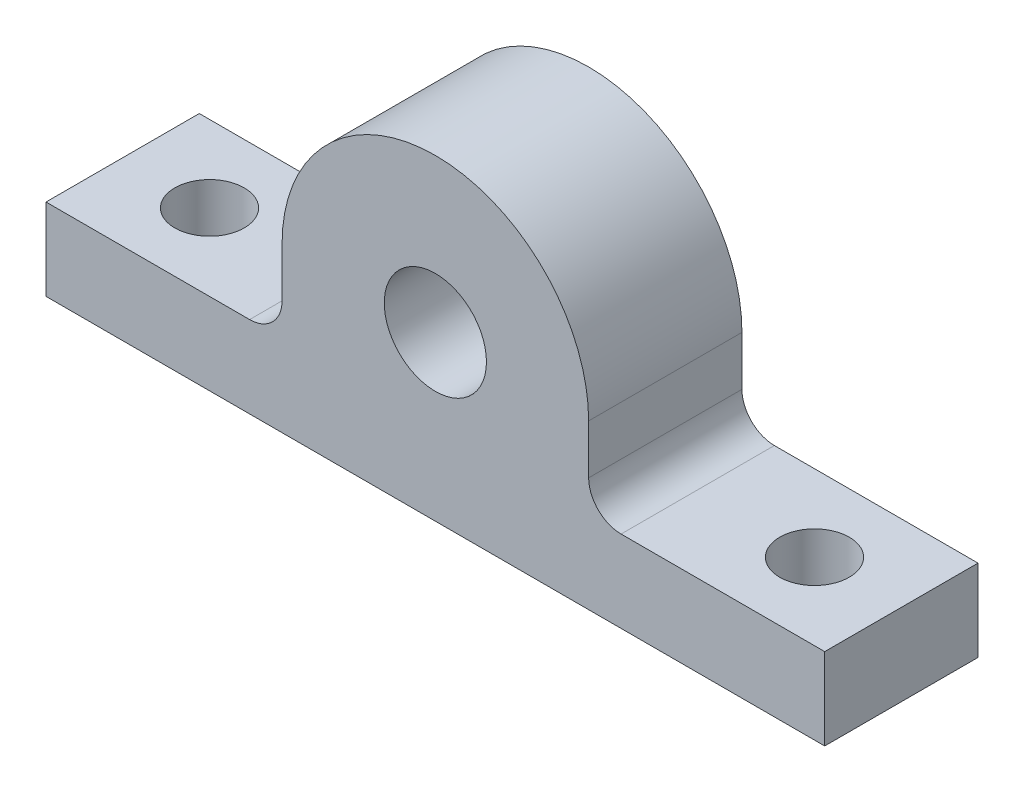
ISO-10303-21;
HEADER;
FILE_DESCRIPTION(('STEP AP214'),'2;1');
FILE_NAME('part.step','',(''),(''),'','','');
FILE_SCHEMA(('AUTOMOTIVE_DESIGN { 1 0 10303 214 1 1 1 1 }'));
ENDSEC;
DATA;
#1=APPLICATION_CONTEXT('core data for automotive mechanical design processes');
#2=APPLICATION_PROTOCOL_DEFINITION('international standard','automotive_design',2000,#1);
#3=PRODUCT_CONTEXT('',#1,'mechanical');
#4=PRODUCT('Part','Part','',(#3));
#5=PRODUCT_RELATED_PRODUCT_CATEGORY('part','',(#4));
#6=PRODUCT_DEFINITION_FORMATION('','',#4);
#7=PRODUCT_DEFINITION_CONTEXT('part definition',#1,'design');
#8=PRODUCT_DEFINITION('design','',#6,#7);
#9=PRODUCT_DEFINITION_SHAPE('','',#8);
#10=(LENGTH_UNIT() NAMED_UNIT(*) SI_UNIT(.MILLI.,.METRE.));
#11=(NAMED_UNIT(*) PLANE_ANGLE_UNIT() SI_UNIT($,.RADIAN.));
#12=(NAMED_UNIT(*) SI_UNIT($,.STERADIAN.) SOLID_ANGLE_UNIT());
#13=UNCERTAINTY_MEASURE_WITH_UNIT(LENGTH_MEASURE(1.E-05),#10,'distance_accuracy_value','');
#14=(GEOMETRIC_REPRESENTATION_CONTEXT(3) GLOBAL_UNCERTAINTY_ASSIGNED_CONTEXT((#13)) GLOBAL_UNIT_ASSIGNED_CONTEXT((#10,
#11,#12)) REPRESENTATION_CONTEXT('',''));
#15=CARTESIAN_POINT('',(0.,0.,0.));
#16=DIRECTION('',(0.,0.,1.));
#17=DIRECTION('',(1.,0.,0.));
#18=AXIS2_PLACEMENT_3D('',#15,#16,#17);
#19=CARTESIAN_POINT('',(15.,0.,15.));
#20=DIRECTION('',(-1.,0.,0.));
#21=DIRECTION('',(0.,0.,1.));
#22=AXIS2_PLACEMENT_3D('',#19,#20,#21);
#23=PLANE('',#22);
#24=DIRECTION('',(0.,1.,0.));
#25=VECTOR('',#24,1.);
#26=CARTESIAN_POINT('',(15.,0.,15.));
#27=LINE('',#26,#25);
#28=CARTESIAN_POINT('',(15.,7.175,15.));
#29=VERTEX_POINT('',#28);
#30=CARTESIAN_POINT('',(15.,12.,15.));
#31=VERTEX_POINT('',#30);
#32=EDGE_CURVE('E109',#29,#31,#27,.T.);
#33=ORIENTED_EDGE('',*,*,#32,.F.);
#34=DIRECTION('',(0.,0.,-1.));
#35=VECTOR('',#34,1.);
#36=CARTESIAN_POINT('',(15.,7.175,15.));
#37=LINE('',#36,#35);
#38=CARTESIAN_POINT('',(15.,7.175,0.));
#39=VERTEX_POINT('',#38);
#40=EDGE_CURVE('E189',#29,#39,#37,.T.);
#41=ORIENTED_EDGE('',*,*,#40,.T.);
#42=DIRECTION('',(0.,1.,0.));
#43=VECTOR('',#42,1.);
#44=CARTESIAN_POINT('',(15.,0.,0.));
#45=LINE('',#44,#43);
#46=CARTESIAN_POINT('',(15.,12.,0.));
#47=VERTEX_POINT('',#46);
#48=EDGE_CURVE('E124',#39,#47,#45,.T.);
#49=ORIENTED_EDGE('',*,*,#48,.T.);
#50=DIRECTION('',(0.,0.,-1.));
#51=VECTOR('',#50,1.);
#52=CARTESIAN_POINT('',(15.,12.,15.));
#53=LINE('',#52,#51);
#54=EDGE_CURVE('E123',#31,#47,#53,.T.);
#55=ORIENTED_EDGE('',*,*,#54,.F.);
#56=EDGE_LOOP('',(#33,#41,#49,#55));
#57=FACE_BOUND('',#56,.T.);
#58=ADVANCED_FACE('F34',(#57),#23,.F.);
#59=CARTESIAN_POINT('',(0.,12.,15.));
#60=DIRECTION('',(0.,0.,-1.));
#61=DIRECTION('',(-1.,0.,0.));
#62=AXIS2_PLACEMENT_3D('',#59,#60,#61);
#63=CYLINDRICAL_SURFACE('',#62,15.);
#64=CARTESIAN_POINT('',(0.,12.,0.));
#65=DIRECTION('',(0.,0.,1.));
#66=DIRECTION('',(1.,0.,0.));
#67=AXIS2_PLACEMENT_3D('',#64,#65,#66);
#68=CIRCLE('',#67,15.);
#69=CARTESIAN_POINT('',(-15.,12.,0.));
#70=VERTEX_POINT('',#69);
#71=EDGE_CURVE('E156',#70,#47,#68,.F.);
#72=ORIENTED_EDGE('',*,*,#71,.F.);
#73=DIRECTION('',(0.,0.,-1.));
#74=VECTOR('',#73,1.);
#75=CARTESIAN_POINT('',(-15.,12.,15.));
#76=LINE('',#75,#74);
#77=CARTESIAN_POINT('',(-15.,12.,15.));
#78=VERTEX_POINT('',#77);
#79=EDGE_CURVE('E129',#78,#70,#76,.T.);
#80=ORIENTED_EDGE('',*,*,#79,.F.);
#81=CARTESIAN_POINT('',(0.,12.,15.));
#82=DIRECTION('',(0.,0.,1.));
#83=DIRECTION('',(1.,0.,0.));
#84=AXIS2_PLACEMENT_3D('',#81,#82,#83);
#85=CIRCLE('',#84,15.);
#86=EDGE_CURVE('E115',#78,#31,#85,.F.);
#87=ORIENTED_EDGE('',*,*,#86,.T.);
#88=ORIENTED_EDGE('',*,*,#54,.T.);
#89=EDGE_LOOP('',(#72,#80,#87,#88));
#90=FACE_BOUND('',#89,.T.);
#91=ADVANCED_FACE('F132',(#90),#63,.T.);
#92=CARTESIAN_POINT('',(-15.,0.,15.));
#93=DIRECTION('',(-1.,0.,0.));
#94=DIRECTION('',(0.,0.,1.));
#95=AXIS2_PLACEMENT_3D('',#92,#93,#94);
#96=PLANE('',#95);
#97=DIRECTION('',(0.,1.,0.));
#98=VECTOR('',#97,1.);
#99=CARTESIAN_POINT('',(-15.,0.,0.));
#100=LINE('',#99,#98);
#101=CARTESIAN_POINT('',(-15.,7.175,0.));
#102=VERTEX_POINT('',#101);
#103=EDGE_CURVE('E159',#102,#70,#100,.T.);
#104=ORIENTED_EDGE('',*,*,#103,.F.);
#105=DIRECTION('',(0.,0.,-1.));
#106=VECTOR('',#105,1.);
#107=CARTESIAN_POINT('',(-15.,7.175,15.));
#108=LINE('',#107,#106);
#109=CARTESIAN_POINT('',(-15.,7.175,15.));
#110=VERTEX_POINT('',#109);
#111=EDGE_CURVE('E187',#102,#110,#108,.F.);
#112=ORIENTED_EDGE('',*,*,#111,.T.);
#113=DIRECTION('',(0.,1.,0.));
#114=VECTOR('',#113,1.);
#115=CARTESIAN_POINT('',(-15.,0.,15.));
#116=LINE('',#115,#114);
#117=EDGE_CURVE('E134',#110,#78,#116,.T.);
#118=ORIENTED_EDGE('',*,*,#117,.T.);
#119=ORIENTED_EDGE('',*,*,#79,.T.);
#120=EDGE_LOOP('',(#104,#112,#118,#119));
#121=FACE_BOUND('',#120,.T.);
#122=ADVANCED_FACE('F209',(#121),#96,.T.);
#123=CARTESIAN_POINT('',(0.,4.,15.));
#124=DIRECTION('',(0.,1.,0.));
#125=DIRECTION('',(0.,0.,1.));
#126=AXIS2_PLACEMENT_3D('',#123,#124,#125);
#127=PLANE('',#126);
#128=CARTESIAN_POINT('',(-29.6,4.,7.5));
#129=DIRECTION('',(0.,1.,0.));
#130=DIRECTION('',(0.,0.,1.));
#131=AXIS2_PLACEMENT_3D('',#128,#129,#130);
#132=CIRCLE('',#131,3.4);
#133=CARTESIAN_POINT('',(-29.6,4.,10.9));
#134=VERTEX_POINT('',#133);
#135=EDGE_CURVE('E375',#134,#134,#132,.T.);
#136=ORIENTED_EDGE('',*,*,#135,.F.);
#137=EDGE_LOOP('',(#136));
#138=FACE_BOUND('',#137,.T.);
#139=DIRECTION('',(1.,0.,0.));
#140=VECTOR('',#139,1.);
#141=CARTESIAN_POINT('',(0.,4.,15.));
#142=LINE('',#141,#140);
#143=CARTESIAN_POINT('',(-38.1,4.,15.));
#144=VERTEX_POINT('',#143);
#145=CARTESIAN_POINT('',(-18.175,4.,15.));
#146=VERTEX_POINT('',#145);
#147=EDGE_CURVE('E136',#144,#146,#142,.T.);
#148=ORIENTED_EDGE('',*,*,#147,.T.);
#149=DIRECTION('',(0.,0.,-1.));
#150=VECTOR('',#149,1.);
#151=CARTESIAN_POINT('',(-18.175,4.,0.));
#152=LINE('',#151,#150);
#153=CARTESIAN_POINT('',(-18.175,4.,0.));
#154=VERTEX_POINT('',#153);
#155=EDGE_CURVE('E128',#146,#154,#152,.T.);
#156=ORIENTED_EDGE('',*,*,#155,.T.);
#157=DIRECTION('',(1.,0.,0.));
#158=VECTOR('',#157,1.);
#159=CARTESIAN_POINT('',(0.,4.,0.));
#160=LINE('',#159,#158);
#161=CARTESIAN_POINT('',(-38.1,4.,0.));
#162=VERTEX_POINT('',#161);
#163=EDGE_CURVE('E161',#162,#154,#160,.T.);
#164=ORIENTED_EDGE('',*,*,#163,.F.);
#165=DIRECTION('',(0.,0.,-1.));
#166=VECTOR('',#165,1.);
#167=CARTESIAN_POINT('',(-38.1,4.,15.));
#168=LINE('',#167,#166);
#169=EDGE_CURVE('E182',#144,#162,#168,.T.);
#170=ORIENTED_EDGE('',*,*,#169,.F.);
#171=EDGE_LOOP('',(#148,#156,#164,#170));
#172=FACE_BOUND('',#171,.T.);
#173=ADVANCED_FACE('F202',(#138,#172),#127,.T.);
#174=CARTESIAN_POINT('',(-38.1,0.,15.));
#175=DIRECTION('',(-1.,0.,0.));
#176=DIRECTION('',(0.,0.,1.));
#177=AXIS2_PLACEMENT_3D('',#174,#175,#176);
#178=PLANE('',#177);
#179=DIRECTION('',(0.,1.,0.));
#180=VECTOR('',#179,1.);
#181=CARTESIAN_POINT('',(-38.1,0.,0.));
#182=LINE('',#181,#180);
#183=CARTESIAN_POINT('',(-38.1,-4.,0.));
#184=VERTEX_POINT('',#183);
#185=EDGE_CURVE('E164',#184,#162,#182,.T.);
#186=ORIENTED_EDGE('',*,*,#185,.F.);
#187=DIRECTION('',(0.,0.,-1.));
#188=VECTOR('',#187,1.);
#189=CARTESIAN_POINT('',(-38.1,-4.,15.));
#190=LINE('',#189,#188);
#191=CARTESIAN_POINT('',(-38.1,-4.,15.));
#192=VERTEX_POINT('',#191);
#193=EDGE_CURVE('E180',#192,#184,#190,.T.);
#194=ORIENTED_EDGE('',*,*,#193,.F.);
#195=DIRECTION('',(0.,1.,0.));
#196=VECTOR('',#195,1.);
#197=CARTESIAN_POINT('',(-38.1,0.,15.));
#198=LINE('',#197,#196);
#199=EDGE_CURVE('E142',#192,#144,#198,.T.);
#200=ORIENTED_EDGE('',*,*,#199,.T.);
#201=ORIENTED_EDGE('',*,*,#169,.T.);
#202=EDGE_LOOP('',(#186,#194,#200,#201));
#203=FACE_BOUND('',#202,.T.);
#204=ADVANCED_FACE('F216',(#203),#178,.T.);
#205=CARTESIAN_POINT('',(0.,-4.,15.));
#206=DIRECTION('',(0.,1.,0.));
#207=DIRECTION('',(0.,0.,1.));
#208=AXIS2_PLACEMENT_3D('',#205,#206,#207);
#209=PLANE('',#208);
#210=CARTESIAN_POINT('',(29.6,-4.,7.5));
#211=DIRECTION('',(0.,1.,0.));
#212=DIRECTION('',(0.,0.,1.));
#213=AXIS2_PLACEMENT_3D('',#210,#211,#212);
#214=CIRCLE('',#213,3.4);
#215=CARTESIAN_POINT('',(29.6,-4.,10.9));
#216=VERTEX_POINT('',#215);
#217=EDGE_CURVE('E374',#216,#216,#214,.T.);
#218=ORIENTED_EDGE('',*,*,#217,.T.);
#219=EDGE_LOOP('',(#218));
#220=FACE_BOUND('',#219,.T.);
#221=CARTESIAN_POINT('',(-29.6,-4.,7.5));
#222=DIRECTION('',(0.,1.,0.));
#223=DIRECTION('',(0.,0.,1.));
#224=AXIS2_PLACEMENT_3D('',#221,#222,#223);
#225=CIRCLE('',#224,3.4);
#226=CARTESIAN_POINT('',(-29.6,-4.,10.9));
#227=VERTEX_POINT('',#226);
#228=EDGE_CURVE('E157',#227,#227,#225,.T.);
#229=ORIENTED_EDGE('',*,*,#228,.T.);
#230=EDGE_LOOP('',(#229));
#231=FACE_BOUND('',#230,.T.);
#232=DIRECTION('',(1.,0.,0.));
#233=VECTOR('',#232,1.);
#234=CARTESIAN_POINT('',(0.,-4.,0.));
#235=LINE('',#234,#233);
#236=CARTESIAN_POINT('',(38.1,-4.,0.));
#237=VERTEX_POINT('',#236);
#238=EDGE_CURVE('E168',#184,#237,#235,.T.);
#239=ORIENTED_EDGE('',*,*,#238,.T.);
#240=DIRECTION('',(0.,0.,-1.));
#241=VECTOR('',#240,1.);
#242=CARTESIAN_POINT('',(38.1,-4.,15.));
#243=LINE('',#242,#241);
#244=CARTESIAN_POINT('',(38.1,-4.,15.));
#245=VERTEX_POINT('',#244);
#246=EDGE_CURVE('E177',#245,#237,#243,.T.);
#247=ORIENTED_EDGE('',*,*,#246,.F.);
#248=DIRECTION('',(1.,0.,0.));
#249=VECTOR('',#248,1.);
#250=CARTESIAN_POINT('',(0.,-4.,15.));
#251=LINE('',#250,#249);
#252=EDGE_CURVE('E146',#192,#245,#251,.T.);
#253=ORIENTED_EDGE('',*,*,#252,.F.);
#254=ORIENTED_EDGE('',*,*,#193,.T.);
#255=EDGE_LOOP('',(#239,#247,#253,#254));
#256=FACE_BOUND('',#255,.T.);
#257=ADVANCED_FACE('F249',(#220,#231,#256),#209,.F.);
#258=CARTESIAN_POINT('',(38.1,0.,15.));
#259=DIRECTION('',(-1.,0.,0.));
#260=DIRECTION('',(0.,0.,1.));
#261=AXIS2_PLACEMENT_3D('',#258,#259,#260);
#262=PLANE('',#261);
#263=DIRECTION('',(0.,1.,0.));
#264=VECTOR('',#263,1.);
#265=CARTESIAN_POINT('',(38.1,0.,0.));
#266=LINE('',#265,#264);
#267=CARTESIAN_POINT('',(38.1,4.,0.));
#268=VERTEX_POINT('',#267);
#269=EDGE_CURVE('E170',#237,#268,#266,.T.);
#270=ORIENTED_EDGE('',*,*,#269,.T.);
#271=DIRECTION('',(0.,0.,-1.));
#272=VECTOR('',#271,1.);
#273=CARTESIAN_POINT('',(38.1,4.,15.));
#274=LINE('',#273,#272);
#275=CARTESIAN_POINT('',(38.1,4.,15.));
#276=VERTEX_POINT('',#275);
#277=EDGE_CURVE('E154',#276,#268,#274,.T.);
#278=ORIENTED_EDGE('',*,*,#277,.F.);
#279=DIRECTION('',(0.,1.,0.));
#280=VECTOR('',#279,1.);
#281=CARTESIAN_POINT('',(38.1,0.,15.));
#282=LINE('',#281,#280);
#283=EDGE_CURVE('E148',#245,#276,#282,.T.);
#284=ORIENTED_EDGE('',*,*,#283,.F.);
#285=ORIENTED_EDGE('',*,*,#246,.T.);
#286=EDGE_LOOP('',(#270,#278,#284,#285));
#287=FACE_BOUND('',#286,.T.);
#288=ADVANCED_FACE('F245',(#287),#262,.F.);
#289=CARTESIAN_POINT('',(29.6,4.,7.5));
#290=DIRECTION('',(0.,1.,0.));
#291=DIRECTION('',(0.,0.,1.));
#292=AXIS2_PLACEMENT_3D('',#289,#290,#291);
#293=CIRCLE('',#292,3.4);
#294=CARTESIAN_POINT('',(29.6,4.,10.9));
#295=VERTEX_POINT('',#294);
#296=EDGE_CURVE('E371',#295,#295,#293,.T.);
#297=ORIENTED_EDGE('',*,*,#296,.F.);
#298=EDGE_LOOP('',(#297));
#299=FACE_BOUND('',#298,.T.);
#300=CARTESIAN_POINT('',(18.175,4.,0.));
#301=VERTEX_POINT('',#300);
#302=EDGE_CURVE('E165',#301,#268,#160,.T.);
#303=ORIENTED_EDGE('',*,*,#302,.F.);
#304=DIRECTION('',(0.,0.,-1.));
#305=VECTOR('',#304,1.);
#306=CARTESIAN_POINT('',(18.175,4.,15.));
#307=LINE('',#306,#305);
#308=CARTESIAN_POINT('',(18.175,4.,15.));
#309=VERTEX_POINT('',#308);
#310=EDGE_CURVE('E49',#301,#309,#307,.F.);
#311=ORIENTED_EDGE('',*,*,#310,.T.);
#312=EDGE_CURVE('E143',#309,#276,#142,.T.);
#313=ORIENTED_EDGE('',*,*,#312,.T.);
#314=ORIENTED_EDGE('',*,*,#277,.T.);
#315=EDGE_LOOP('',(#303,#311,#313,#314));
#316=FACE_BOUND('',#315,.T.);
#317=ADVANCED_FACE('F219',(#299,#316),#127,.T.);
#318=CARTESIAN_POINT('',(0.,12.,15.));
#319=DIRECTION('',(0.,0.,-1.));
#320=DIRECTION('',(-1.,0.,0.));
#321=AXIS2_PLACEMENT_3D('',#318,#319,#320);
#322=CYLINDRICAL_SURFACE('',#321,5.);
#323=CARTESIAN_POINT('',(0.,12.,15.));
#324=DIRECTION('',(0.,0.,1.));
#325=DIRECTION('',(1.,0.,0.));
#326=AXIS2_PLACEMENT_3D('',#323,#324,#325);
#327=CIRCLE('',#326,5.);
#328=CARTESIAN_POINT('',(5.,12.,15.));
#329=VERTEX_POINT('',#328);
#330=EDGE_CURVE('E151',#329,#329,#327,.T.);
#331=ORIENTED_EDGE('',*,*,#330,.T.);
#332=EDGE_LOOP('',(#331));
#333=FACE_BOUND('',#332,.T.);
#334=CARTESIAN_POINT('',(0.,12.,0.));
#335=DIRECTION('',(0.,0.,1.));
#336=DIRECTION('',(1.,0.,0.));
#337=AXIS2_PLACEMENT_3D('',#334,#335,#336);
#338=CIRCLE('',#337,5.);
#339=CARTESIAN_POINT('',(5.,12.,0.));
#340=VERTEX_POINT('',#339);
#341=EDGE_CURVE('E120',#340,#340,#338,.T.);
#342=ORIENTED_EDGE('',*,*,#341,.F.);
#343=EDGE_LOOP('',(#342));
#344=FACE_BOUND('',#343,.T.);
#345=ADVANCED_FACE('F237',(#333,#344),#322,.F.);
#346=CARTESIAN_POINT('',(0.,0.,15.));
#347=DIRECTION('',(0.,0.,1.));
#348=DIRECTION('',(1.,0.,0.));
#349=AXIS2_PLACEMENT_3D('',#346,#347,#348);
#350=PLANE('',#349);
#351=ORIENTED_EDGE('',*,*,#312,.F.);
#352=CARTESIAN_POINT('',(18.175,7.175,15.));
#353=DIRECTION('',(0.,0.,1.));
#354=DIRECTION('',(1.,0.,0.));
#355=AXIS2_PLACEMENT_3D('',#352,#353,#354);
#356=CIRCLE('',#355,3.175);
#357=EDGE_CURVE('E11',#309,#29,#356,.F.);
#358=ORIENTED_EDGE('',*,*,#357,.T.);
#359=ORIENTED_EDGE('',*,*,#32,.T.);
#360=ORIENTED_EDGE('',*,*,#86,.F.);
#361=ORIENTED_EDGE('',*,*,#117,.F.);
#362=CARTESIAN_POINT('',(-18.175,7.175,15.));
#363=DIRECTION('',(0.,0.,1.));
#364=DIRECTION('',(1.,0.,0.));
#365=AXIS2_PLACEMENT_3D('',#362,#363,#364);
#366=CIRCLE('',#365,3.175);
#367=EDGE_CURVE('E194',#110,#146,#366,.F.);
#368=ORIENTED_EDGE('',*,*,#367,.T.);
#369=ORIENTED_EDGE('',*,*,#147,.F.);
#370=ORIENTED_EDGE('',*,*,#199,.F.);
#371=ORIENTED_EDGE('',*,*,#252,.T.);
#372=ORIENTED_EDGE('',*,*,#283,.T.);
#373=EDGE_LOOP('',(#351,#358,#359,#360,#361,#368,#369,#370,#371,#372));
#374=FACE_BOUND('',#373,.T.);
#375=ORIENTED_EDGE('',*,*,#330,.F.);
#376=EDGE_LOOP('',(#375));
#377=FACE_BOUND('',#376,.T.);
#378=ADVANCED_FACE('F111',(#374,#377),#350,.T.);
#379=CARTESIAN_POINT('',(0.,0.,0.));
#380=DIRECTION('',(0.,0.,1.));
#381=DIRECTION('',(1.,0.,0.));
#382=AXIS2_PLACEMENT_3D('',#379,#380,#381);
#383=PLANE('',#382);
#384=ORIENTED_EDGE('',*,*,#48,.F.);
#385=CARTESIAN_POINT('',(18.175,7.175,0.));
#386=DIRECTION('',(0.,0.,1.));
#387=DIRECTION('',(1.,0.,0.));
#388=AXIS2_PLACEMENT_3D('',#385,#386,#387);
#389=CIRCLE('',#388,3.175);
#390=EDGE_CURVE('E42',#39,#301,#389,.T.);
#391=ORIENTED_EDGE('',*,*,#390,.T.);
#392=ORIENTED_EDGE('',*,*,#302,.T.);
#393=ORIENTED_EDGE('',*,*,#269,.F.);
#394=ORIENTED_EDGE('',*,*,#238,.F.);
#395=ORIENTED_EDGE('',*,*,#185,.T.);
#396=ORIENTED_EDGE('',*,*,#163,.T.);
#397=CARTESIAN_POINT('',(-18.175,7.175,0.));
#398=DIRECTION('',(0.,0.,1.));
#399=DIRECTION('',(1.,0.,0.));
#400=AXIS2_PLACEMENT_3D('',#397,#398,#399);
#401=CIRCLE('',#400,3.175);
#402=EDGE_CURVE('E192',#154,#102,#401,.T.);
#403=ORIENTED_EDGE('',*,*,#402,.T.);
#404=ORIENTED_EDGE('',*,*,#103,.T.);
#405=ORIENTED_EDGE('',*,*,#71,.T.);
#406=EDGE_LOOP('',(#384,#391,#392,#393,#394,#395,#396,#403,#404,#405));
#407=FACE_BOUND('',#406,.T.);
#408=ORIENTED_EDGE('',*,*,#341,.T.);
#409=EDGE_LOOP('',(#408));
#410=FACE_BOUND('',#409,.T.);
#411=ADVANCED_FACE('F206',(#407,#410),#383,.F.);
#412=CARTESIAN_POINT('',(-18.175,7.175,15.));
#413=DIRECTION('',(0.,0.,1.));
#414=DIRECTION('',(1.,0.,0.));
#415=AXIS2_PLACEMENT_3D('',#412,#413,#414);
#416=CYLINDRICAL_SURFACE('',#415,3.175);
#417=ORIENTED_EDGE('',*,*,#367,.F.);
#418=ORIENTED_EDGE('',*,*,#111,.F.);
#419=ORIENTED_EDGE('',*,*,#402,.F.);
#420=ORIENTED_EDGE('',*,*,#155,.F.);
#421=EDGE_LOOP('',(#417,#418,#419,#420));
#422=FACE_BOUND('',#421,.T.);
#423=ADVANCED_FACE('F204',(#422),#416,.F.);
#424=CARTESIAN_POINT('',(18.175,7.175,15.));
#425=DIRECTION('',(0.,0.,-1.));
#426=DIRECTION('',(-1.,0.,0.));
#427=AXIS2_PLACEMENT_3D('',#424,#425,#426);
#428=CYLINDRICAL_SURFACE('',#427,3.175);
#429=ORIENTED_EDGE('',*,*,#357,.F.);
#430=ORIENTED_EDGE('',*,*,#310,.F.);
#431=ORIENTED_EDGE('',*,*,#390,.F.);
#432=ORIENTED_EDGE('',*,*,#40,.F.);
#433=EDGE_LOOP('',(#429,#430,#431,#432));
#434=FACE_BOUND('',#433,.T.);
#435=ADVANCED_FACE('F36',(#434),#428,.F.);
#436=CARTESIAN_POINT('',(-29.6,4.,7.5));
#437=DIRECTION('',(0.,1.,0.));
#438=DIRECTION('',(0.,0.,1.));
#439=AXIS2_PLACEMENT_3D('',#436,#437,#438);
#440=CYLINDRICAL_SURFACE('',#439,3.4);
#441=ORIENTED_EDGE('',*,*,#135,.T.);
#442=EDGE_LOOP('',(#441));
#443=FACE_BOUND('',#442,.T.);
#444=ORIENTED_EDGE('',*,*,#228,.F.);
#445=EDGE_LOOP('',(#444));
#446=FACE_BOUND('',#445,.T.);
#447=ADVANCED_FACE('F231',(#443,#446),#440,.F.);
#448=CARTESIAN_POINT('',(29.6,4.,7.5));
#449=DIRECTION('',(0.,1.,0.));
#450=DIRECTION('',(0.,0.,1.));
#451=AXIS2_PLACEMENT_3D('',#448,#449,#450);
#452=CYLINDRICAL_SURFACE('',#451,3.4);
#453=ORIENTED_EDGE('',*,*,#296,.T.);
#454=EDGE_LOOP('',(#453));
#455=FACE_BOUND('',#454,.T.);
#456=ORIENTED_EDGE('',*,*,#217,.F.);
#457=EDGE_LOOP('',(#456));
#458=FACE_BOUND('',#457,.T.);
#459=ADVANCED_FACE('F355',(#455,#458),#452,.F.);
#460=CLOSED_SHELL('',(#58,#91,#122,#173,#204,#257,#288,#317,#345,#378,#411,#423,#435,#447,#459));
#461=MANIFOLD_SOLID_BREP('B2',#460);
#462=ADVANCED_BREP_SHAPE_REPRESENTATION('',(#18,#461),#14);
#463=SHAPE_DEFINITION_REPRESENTATION(#9,#462);
ENDSEC;
END-ISO-10303-21;
